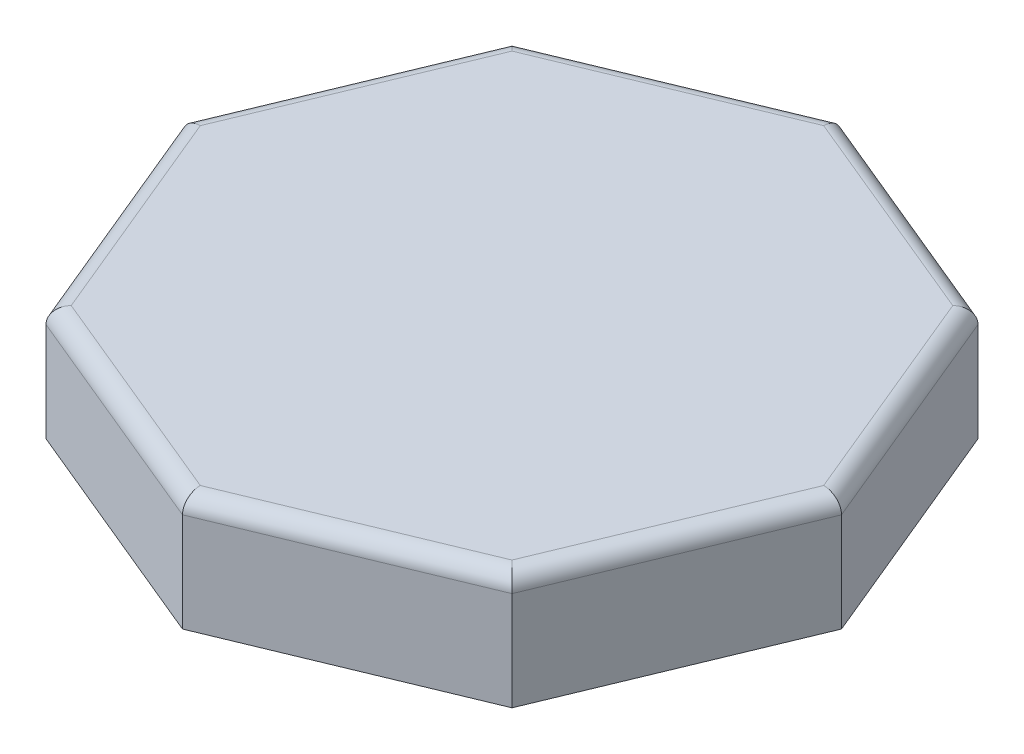
ISO-10303-21;
HEADER;
FILE_DESCRIPTION(('STEP AP214'),'2;1');
FILE_NAME('part.step','',(''),(''),'','','');
FILE_SCHEMA(('AUTOMOTIVE_DESIGN { 1 0 10303 214 1 1 1 1 }'));
ENDSEC;
DATA;
#1=APPLICATION_CONTEXT('core data for automotive mechanical design processes');
#2=APPLICATION_PROTOCOL_DEFINITION('international standard','automotive_design',2000,#1);
#3=PRODUCT_CONTEXT('',#1,'mechanical');
#4=PRODUCT('Part','Part','',(#3));
#5=PRODUCT_RELATED_PRODUCT_CATEGORY('part','',(#4));
#6=PRODUCT_DEFINITION_FORMATION('','',#4);
#7=PRODUCT_DEFINITION_CONTEXT('part definition',#1,'design');
#8=PRODUCT_DEFINITION('design','',#6,#7);
#9=PRODUCT_DEFINITION_SHAPE('','',#8);
#10=(LENGTH_UNIT() NAMED_UNIT(*) SI_UNIT(.MILLI.,.METRE.));
#11=(NAMED_UNIT(*) PLANE_ANGLE_UNIT() SI_UNIT($,.RADIAN.));
#12=(NAMED_UNIT(*) SI_UNIT($,.STERADIAN.) SOLID_ANGLE_UNIT());
#13=UNCERTAINTY_MEASURE_WITH_UNIT(LENGTH_MEASURE(1.E-05),#10,'distance_accuracy_value','');
#14=(GEOMETRIC_REPRESENTATION_CONTEXT(3) GLOBAL_UNCERTAINTY_ASSIGNED_CONTEXT((#13)) GLOBAL_UNIT_ASSIGNED_CONTEXT((#10,
#11,#12)) REPRESENTATION_CONTEXT('',''));
#15=CARTESIAN_POINT('',(0.,0.,0.));
#16=DIRECTION('',(0.,0.,1.));
#17=DIRECTION('',(1.,0.,0.));
#18=AXIS2_PLACEMENT_3D('',#15,#16,#17);
#19=CARTESIAN_POINT('',(0.,70.,199.904133626086));
#20=DIRECTION('',(-0.38268343236509,0.,-0.923879532511286));
#21=DIRECTION('',(-0.923879532511287,0.,0.382683432365091));
#22=AXIS2_PLACEMENT_3D('',#19,#20,#21);
#23=PLANE('',#22);
#24=DIRECTION('',(0.,-1.,0.));
#25=VECTOR('',#24,1.);
#26=CARTESIAN_POINT('',(141.353568474227,70.,141.353568474227));
#27=LINE('',#26,#25);
#28=CARTESIAN_POINT('',(141.353568474227,60.,141.353568474227));
#29=VERTEX_POINT('',#28);
#30=CARTESIAN_POINT('',(141.353568474227,0.,141.353568474227));
#31=VERTEX_POINT('',#30);
#32=EDGE_CURVE('E276',#29,#31,#27,.T.);
#33=ORIENTED_EDGE('',*,*,#32,.F.);
#34=DIRECTION('',(0.923879532511287,0.,-0.382683432365091));
#35=VECTOR('',#34,1.);
#36=CARTESIAN_POINT('',(0.,60.,199.904133626086));
#37=LINE('',#36,#35);
#38=CARTESIAN_POINT('',(0.,60.,199.904133626086));
#39=VERTEX_POINT('',#38);
#40=EDGE_CURVE('E298',#29,#39,#37,.F.);
#41=ORIENTED_EDGE('',*,*,#40,.T.);
#42=DIRECTION('',(0.,-1.,0.));
#43=VECTOR('',#42,1.);
#44=CARTESIAN_POINT('',(0.,70.,199.904133626086));
#45=LINE('',#44,#43);
#46=CARTESIAN_POINT('',(0.,0.,199.904133626086));
#47=VERTEX_POINT('',#46);
#48=EDGE_CURVE('E262',#39,#47,#45,.T.);
#49=ORIENTED_EDGE('',*,*,#48,.T.);
#50=DIRECTION('',(0.923879532511287,0.,-0.38268343236509));
#51=VECTOR('',#50,1.);
#52=CARTESIAN_POINT('',(0.,0.,199.904133626086));
#53=LINE('',#52,#51);
#54=EDGE_CURVE('E238',#47,#31,#53,.T.);
#55=ORIENTED_EDGE('',*,*,#54,.T.);
#56=EDGE_LOOP('',(#33,#41,#49,#55));
#57=FACE_BOUND('',#56,.T.);
#58=ADVANCED_FACE('F32',(#57),#23,.F.);
#59=CARTESIAN_POINT('',(141.353568474227,70.,141.353568474227));
#60=DIRECTION('',(-0.923879532511287,0.,-0.382683432365089));
#61=DIRECTION('',(-0.38268343236509,0.,0.923879532511287));
#62=AXIS2_PLACEMENT_3D('',#59,#60,#61);
#63=PLANE('',#62);
#64=DIRECTION('',(0.,-1.,0.));
#65=VECTOR('',#64,1.);
#66=CARTESIAN_POINT('',(199.904133626086,70.,0.));
#67=LINE('',#66,#65);
#68=CARTESIAN_POINT('',(199.904133626086,60.,0.));
#69=VERTEX_POINT('',#68);
#70=CARTESIAN_POINT('',(199.904133626086,0.,0.));
#71=VERTEX_POINT('',#70);
#72=EDGE_CURVE('E274',#69,#71,#67,.T.);
#73=ORIENTED_EDGE('',*,*,#72,.F.);
#74=DIRECTION('',(0.38268343236509,0.,-0.923879532511287));
#75=VECTOR('',#74,1.);
#76=CARTESIAN_POINT('',(141.353568474227,60.,141.353568474227));
#77=LINE('',#76,#75);
#78=EDGE_CURVE('E295',#69,#29,#77,.F.);
#79=ORIENTED_EDGE('',*,*,#78,.T.);
#80=ORIENTED_EDGE('',*,*,#32,.T.);
#81=DIRECTION('',(0.382683432365089,0.,-0.923879532511287));
#82=VECTOR('',#81,1.);
#83=CARTESIAN_POINT('',(141.353568474227,0.,141.353568474227));
#84=LINE('',#83,#82);
#85=EDGE_CURVE('E241',#31,#71,#84,.T.);
#86=ORIENTED_EDGE('',*,*,#85,.T.);
#87=EDGE_LOOP('',(#73,#79,#80,#86));
#88=FACE_BOUND('',#87,.T.);
#89=ADVANCED_FACE('F450',(#88),#63,.F.);
#90=CARTESIAN_POINT('',(199.904133626086,70.,0.));
#91=DIRECTION('',(-0.923879532511287,0.,0.382683432365089));
#92=DIRECTION('',(0.382683432365089,0.,0.923879532511287));
#93=AXIS2_PLACEMENT_3D('',#90,#91,#92);
#94=PLANE('',#93);
#95=DIRECTION('',(0.,-1.,0.));
#96=VECTOR('',#95,1.);
#97=CARTESIAN_POINT('',(141.353568474227,70.,-141.353568474227));
#98=LINE('',#97,#96);
#99=CARTESIAN_POINT('',(141.353568474227,60.,-141.353568474227));
#100=VERTEX_POINT('',#99);
#101=CARTESIAN_POINT('',(141.353568474227,0.,-141.353568474227));
#102=VERTEX_POINT('',#101);
#103=EDGE_CURVE('E272',#100,#102,#98,.T.);
#104=ORIENTED_EDGE('',*,*,#103,.F.);
#105=DIRECTION('',(-0.382683432365089,0.,-0.923879532511287));
#106=VECTOR('',#105,1.);
#107=CARTESIAN_POINT('',(199.904133626086,60.,0.));
#108=LINE('',#107,#106);
#109=EDGE_CURVE('E310',#100,#69,#108,.F.);
#110=ORIENTED_EDGE('',*,*,#109,.T.);
#111=ORIENTED_EDGE('',*,*,#72,.T.);
#112=DIRECTION('',(-0.382683432365089,0.,-0.923879532511287));
#113=VECTOR('',#112,1.);
#114=CARTESIAN_POINT('',(199.904133626086,0.,0.));
#115=LINE('',#114,#113);
#116=EDGE_CURVE('E244',#71,#102,#115,.T.);
#117=ORIENTED_EDGE('',*,*,#116,.T.);
#118=EDGE_LOOP('',(#104,#110,#111,#117));
#119=FACE_BOUND('',#118,.T.);
#120=ADVANCED_FACE('F456',(#119),#94,.F.);
#121=CARTESIAN_POINT('',(141.353568474227,70.,-141.353568474227));
#122=DIRECTION('',(-0.38268343236509,0.,0.923879532511286));
#123=DIRECTION('',(0.923879532511287,0.,0.382683432365091));
#124=AXIS2_PLACEMENT_3D('',#121,#122,#123);
#125=PLANE('',#124);
#126=DIRECTION('',(0.,-1.,0.));
#127=VECTOR('',#126,1.);
#128=CARTESIAN_POINT('',(0.,70.,-199.904133626086));
#129=LINE('',#128,#127);
#130=CARTESIAN_POINT('',(0.,60.,-199.904133626086));
#131=VERTEX_POINT('',#130);
#132=CARTESIAN_POINT('',(0.,0.,-199.904133626086));
#133=VERTEX_POINT('',#132);
#134=EDGE_CURVE('E270',#131,#133,#129,.T.);
#135=ORIENTED_EDGE('',*,*,#134,.F.);
#136=DIRECTION('',(-0.923879532511287,0.,-0.382683432365091));
#137=VECTOR('',#136,1.);
#138=CARTESIAN_POINT('',(141.353568474227,60.,-141.353568474227));
#139=LINE('',#138,#137);
#140=EDGE_CURVE('E308',#131,#100,#139,.F.);
#141=ORIENTED_EDGE('',*,*,#140,.T.);
#142=ORIENTED_EDGE('',*,*,#103,.T.);
#143=DIRECTION('',(-0.923879532511287,0.,-0.38268343236509));
#144=VECTOR('',#143,1.);
#145=CARTESIAN_POINT('',(141.353568474227,0.,-141.353568474227));
#146=LINE('',#145,#144);
#147=EDGE_CURVE('E247',#102,#133,#146,.T.);
#148=ORIENTED_EDGE('',*,*,#147,.T.);
#149=EDGE_LOOP('',(#135,#141,#142,#148));
#150=FACE_BOUND('',#149,.T.);
#151=ADVANCED_FACE('F510',(#150),#125,.F.);
#152=CARTESIAN_POINT('',(0.,70.,-199.904133626086));
#153=DIRECTION('',(0.38268343236509,0.,0.923879532511287));
#154=DIRECTION('',(0.923879532511287,0.,-0.38268343236509));
#155=AXIS2_PLACEMENT_3D('',#152,#153,#154);
#156=PLANE('',#155);
#157=DIRECTION('',(0.,-1.,0.));
#158=VECTOR('',#157,1.);
#159=CARTESIAN_POINT('',(-141.353568474227,70.,-141.353568474227));
#160=LINE('',#159,#158);
#161=CARTESIAN_POINT('',(-141.353568474227,60.,-141.353568474227));
#162=VERTEX_POINT('',#161);
#163=CARTESIAN_POINT('',(-141.353568474227,0.,-141.353568474227));
#164=VERTEX_POINT('',#163);
#165=EDGE_CURVE('E268',#162,#164,#160,.T.);
#166=ORIENTED_EDGE('',*,*,#165,.F.);
#167=DIRECTION('',(-0.923879532511287,0.,0.38268343236509));
#168=VECTOR('',#167,1.);
#169=CARTESIAN_POINT('',(0.,60.,-199.904133626086));
#170=LINE('',#169,#168);
#171=EDGE_CURVE('E306',#162,#131,#170,.F.);
#172=ORIENTED_EDGE('',*,*,#171,.T.);
#173=ORIENTED_EDGE('',*,*,#134,.T.);
#174=DIRECTION('',(-0.923879532511287,0.,0.38268343236509));
#175=VECTOR('',#174,1.);
#176=CARTESIAN_POINT('',(0.,0.,-199.904133626086));
#177=LINE('',#176,#175);
#178=EDGE_CURVE('E250',#133,#164,#177,.T.);
#179=ORIENTED_EDGE('',*,*,#178,.T.);
#180=EDGE_LOOP('',(#166,#172,#173,#179));
#181=FACE_BOUND('',#180,.T.);
#182=ADVANCED_FACE('F508',(#181),#156,.F.);
#183=CARTESIAN_POINT('',(-141.353568474227,70.,-141.353568474227));
#184=DIRECTION('',(0.923879532511286,0.,0.38268343236509));
#185=DIRECTION('',(0.382683432365091,0.,-0.923879532511287));
#186=AXIS2_PLACEMENT_3D('',#183,#184,#185);
#187=PLANE('',#186);
#188=DIRECTION('',(0.,-1.,0.));
#189=VECTOR('',#188,1.);
#190=CARTESIAN_POINT('',(-199.904133626086,70.,-1.08143630312998E-13));
#191=LINE('',#190,#189);
#192=CARTESIAN_POINT('',(-199.904133626086,60.,-1.08143630312998E-13));
#193=VERTEX_POINT('',#192);
#194=CARTESIAN_POINT('',(-199.904133626086,0.,-1.08143630312998E-13));
#195=VERTEX_POINT('',#194);
#196=EDGE_CURVE('E266',#193,#195,#191,.T.);
#197=ORIENTED_EDGE('',*,*,#196,.F.);
#198=DIRECTION('',(-0.382683432365091,0.,0.923879532511287));
#199=VECTOR('',#198,1.);
#200=CARTESIAN_POINT('',(-141.353568474227,60.,-141.353568474227));
#201=LINE('',#200,#199);
#202=EDGE_CURVE('E304',#193,#162,#201,.F.);
#203=ORIENTED_EDGE('',*,*,#202,.T.);
#204=ORIENTED_EDGE('',*,*,#165,.T.);
#205=DIRECTION('',(-0.38268343236509,0.,0.923879532511286));
#206=VECTOR('',#205,1.);
#207=CARTESIAN_POINT('',(-141.353568474227,0.,-141.353568474227));
#208=LINE('',#207,#206);
#209=EDGE_CURVE('E253',#164,#195,#208,.T.);
#210=ORIENTED_EDGE('',*,*,#209,.T.);
#211=EDGE_LOOP('',(#197,#203,#204,#210));
#212=FACE_BOUND('',#211,.T.);
#213=ADVANCED_FACE('F521',(#212),#187,.F.);
#214=CARTESIAN_POINT('',(-199.904133626086,70.,-1.08143630312998E-13));
#215=DIRECTION('',(0.923879532511287,0.,-0.38268343236509));
#216=DIRECTION('',(-0.38268343236509,0.,-0.923879532511287));
#217=AXIS2_PLACEMENT_3D('',#214,#215,#216);
#218=PLANE('',#217);
#219=DIRECTION('',(0.,-1.,0.));
#220=VECTOR('',#219,1.);
#221=CARTESIAN_POINT('',(-141.353568474227,70.,141.353568474227));
#222=LINE('',#221,#220);
#223=CARTESIAN_POINT('',(-141.353568474227,60.,141.353568474227));
#224=VERTEX_POINT('',#223);
#225=CARTESIAN_POINT('',(-141.353568474227,0.,141.353568474227));
#226=VERTEX_POINT('',#225);
#227=EDGE_CURVE('E264',#224,#226,#222,.T.);
#228=ORIENTED_EDGE('',*,*,#227,.F.);
#229=DIRECTION('',(0.38268343236509,0.,0.923879532511287));
#230=VECTOR('',#229,1.);
#231=CARTESIAN_POINT('',(-199.904133626086,60.,-1.29109219494897E-13));
#232=LINE('',#231,#230);
#233=EDGE_CURVE('E302',#224,#193,#232,.F.);
#234=ORIENTED_EDGE('',*,*,#233,.T.);
#235=ORIENTED_EDGE('',*,*,#196,.T.);
#236=DIRECTION('',(0.38268343236509,0.,0.923879532511287));
#237=VECTOR('',#236,1.);
#238=CARTESIAN_POINT('',(-199.904133626086,0.,-1.08143630312998E-13));
#239=LINE('',#238,#237);
#240=EDGE_CURVE('E256',#195,#226,#239,.T.);
#241=ORIENTED_EDGE('',*,*,#240,.T.);
#242=EDGE_LOOP('',(#228,#234,#235,#241));
#243=FACE_BOUND('',#242,.T.);
#244=ADVANCED_FACE('F524',(#243),#218,.F.);
#245=CARTESIAN_POINT('',(-141.353568474227,70.,141.353568474227));
#246=DIRECTION('',(0.38268343236509,0.,-0.923879532511287));
#247=DIRECTION('',(-0.923879532511287,0.,-0.38268343236509));
#248=AXIS2_PLACEMENT_3D('',#245,#246,#247);
#249=PLANE('',#248);
#250=ORIENTED_EDGE('',*,*,#48,.F.);
#251=DIRECTION('',(0.923879532511287,0.,0.38268343236509));
#252=VECTOR('',#251,1.);
#253=CARTESIAN_POINT('',(-141.353568474227,60.,141.353568474227));
#254=LINE('',#253,#252);
#255=EDGE_CURVE('E300',#39,#224,#254,.F.);
#256=ORIENTED_EDGE('',*,*,#255,.T.);
#257=ORIENTED_EDGE('',*,*,#227,.T.);
#258=DIRECTION('',(0.923879532511287,0.,0.38268343236509));
#259=VECTOR('',#258,1.);
#260=CARTESIAN_POINT('',(-141.353568474227,0.,141.353568474227));
#261=LINE('',#260,#259);
#262=EDGE_CURVE('E259',#226,#47,#261,.T.);
#263=ORIENTED_EDGE('',*,*,#262,.T.);
#264=EDGE_LOOP('',(#250,#256,#257,#263));
#265=FACE_BOUND('',#264,.T.);
#266=ADVANCED_FACE('F548',(#265),#249,.F.);
#267=CARTESIAN_POINT('',(0.,70.,0.));
#268=DIRECTION('',(0.,1.,0.));
#269=DIRECTION('',(0.,0.,1.));
#270=AXIS2_PLACEMENT_3D('',#267,#268,#269);
#271=PLANE('',#270);
#272=DIRECTION('',(0.923879532511287,0.,-0.382683432365091));
#273=VECTOR('',#272,1.);
#274=CARTESIAN_POINT('',(137.526734150576,70.,132.114773149114));
#275=LINE('',#274,#273);
#276=CARTESIAN_POINT('',(0.,70.,189.080211623162));
#277=VERTEX_POINT('',#276);
#278=CARTESIAN_POINT('',(133.699899826925,70.,133.699899826925));
#279=VERTEX_POINT('',#278);
#280=EDGE_CURVE('E290',#277,#279,#275,.T.);
#281=ORIENTED_EDGE('',*,*,#280,.T.);
#282=DIRECTION('',(0.38268343236509,0.,-0.923879532511287));
#283=VECTOR('',#282,1.);
#284=CARTESIAN_POINT('',(190.665338300973,70.,-3.82683432365089));
#285=LINE('',#284,#283);
#286=CARTESIAN_POINT('',(189.080211623162,70.,0.));
#287=VERTEX_POINT('',#286);
#288=EDGE_CURVE('E292',#279,#287,#285,.T.);
#289=ORIENTED_EDGE('',*,*,#288,.T.);
#290=DIRECTION('',(-0.382683432365089,0.,-0.923879532511287));
#291=VECTOR('',#290,1.);
#292=CARTESIAN_POINT('',(132.114773149114,70.,-137.526734150576));
#293=LINE('',#292,#291);
#294=CARTESIAN_POINT('',(133.699899826925,70.,-133.699899826925));
#295=VERTEX_POINT('',#294);
#296=EDGE_CURVE('E278',#287,#295,#293,.T.);
#297=ORIENTED_EDGE('',*,*,#296,.T.);
#298=DIRECTION('',(-0.923879532511287,0.,-0.382683432365091));
#299=VECTOR('',#298,1.);
#300=CARTESIAN_POINT('',(-3.82683432365093,70.,-190.665338300973));
#301=LINE('',#300,#299);
#302=CARTESIAN_POINT('',(0.,70.,-189.080211623162));
#303=VERTEX_POINT('',#302);
#304=EDGE_CURVE('E280',#295,#303,#301,.T.);
#305=ORIENTED_EDGE('',*,*,#304,.T.);
#306=DIRECTION('',(-0.923879532511287,0.,0.38268343236509));
#307=VECTOR('',#306,1.);
#308=CARTESIAN_POINT('',(-137.526734150576,70.,-132.114773149114));
#309=LINE('',#308,#307);
#310=CARTESIAN_POINT('',(-133.699899826925,70.,-133.699899826925));
#311=VERTEX_POINT('',#310);
#312=EDGE_CURVE('E282',#303,#311,#309,.T.);
#313=ORIENTED_EDGE('',*,*,#312,.T.);
#314=DIRECTION('',(-0.382683432365091,0.,0.923879532511287));
#315=VECTOR('',#314,1.);
#316=CARTESIAN_POINT('',(-190.665338300973,70.,3.82683432365082));
#317=LINE('',#316,#315);
#318=CARTESIAN_POINT('',(-189.080211623162,70.,-1.07514752832717E-13));
#319=VERTEX_POINT('',#318);
#320=EDGE_CURVE('E284',#311,#319,#317,.T.);
#321=ORIENTED_EDGE('',*,*,#320,.T.);
#322=DIRECTION('',(0.38268343236509,0.,0.923879532511287));
#323=VECTOR('',#322,1.);
#324=CARTESIAN_POINT('',(-132.114773149114,70.,137.526734150576));
#325=LINE('',#324,#323);
#326=CARTESIAN_POINT('',(-133.699899826925,70.,133.699899826925));
#327=VERTEX_POINT('',#326);
#328=EDGE_CURVE('E286',#319,#327,#325,.T.);
#329=ORIENTED_EDGE('',*,*,#328,.T.);
#330=DIRECTION('',(0.923879532511287,0.,0.38268343236509));
#331=VECTOR('',#330,1.);
#332=CARTESIAN_POINT('',(3.82683432365094,70.,190.665338300973));
#333=LINE('',#332,#331);
#334=EDGE_CURVE('E288',#327,#277,#333,.T.);
#335=ORIENTED_EDGE('',*,*,#334,.T.);
#336=EDGE_LOOP('',(#281,#289,#297,#305,#313,#321,#329,#335));
#337=FACE_BOUND('',#336,.T.);
#338=ADVANCED_FACE('F533',(#337),#271,.T.);
#339=CARTESIAN_POINT('',(0.,0.,0.));
#340=DIRECTION('',(0.,1.,0.));
#341=DIRECTION('',(0.,0.,1.));
#342=AXIS2_PLACEMENT_3D('',#339,#340,#341);
#343=PLANE('',#342);
#344=DIRECTION('',(0.923879532511287,0.,0.38268343236509));
#345=VECTOR('',#344,1.);
#346=CARTESIAN_POINT('',(-140.205518177132,0.,138.581929876693));
#347=LINE('',#346,#345);
#348=CARTESIAN_POINT('',(-139.057467880036,0.,139.057467880036));
#349=VERTEX_POINT('',#348);
#350=CARTESIAN_POINT('',(0.,0.,196.656957025208));
#351=VERTEX_POINT('',#350);
#352=EDGE_CURVE('E198',#349,#351,#347,.T.);
#353=ORIENTED_EDGE('',*,*,#352,.T.);
#354=DIRECTION('',(0.923879532511287,0.,-0.382683432365091));
#355=VECTOR('',#354,1.);
#356=CARTESIAN_POINT('',(-1.14805029709527,0.,197.132495028552));
#357=LINE('',#356,#355);
#358=CARTESIAN_POINT('',(139.057467880037,0.,139.057467880036));
#359=VERTEX_POINT('',#358);
#360=EDGE_CURVE('E207',#351,#359,#357,.T.);
#361=ORIENTED_EDGE('',*,*,#360,.T.);
#362=DIRECTION('',(0.38268343236509,0.,-0.923879532511287));
#363=VECTOR('',#362,1.);
#364=CARTESIAN_POINT('',(138.581929876693,0.,140.205518177131));
#365=LINE('',#364,#363);
#366=CARTESIAN_POINT('',(196.656957025208,0.,0.));
#367=VERTEX_POINT('',#366);
#368=EDGE_CURVE('E214',#359,#367,#365,.T.);
#369=ORIENTED_EDGE('',*,*,#368,.T.);
#370=DIRECTION('',(-0.382683432365089,0.,-0.923879532511287));
#371=VECTOR('',#370,1.);
#372=CARTESIAN_POINT('',(197.132495028552,0.,1.1480502970953));
#373=LINE('',#372,#371);
#374=CARTESIAN_POINT('',(139.057467880037,0.,-139.057467880036));
#375=VERTEX_POINT('',#374);
#376=EDGE_CURVE('E234',#367,#375,#373,.T.);
#377=ORIENTED_EDGE('',*,*,#376,.T.);
#378=DIRECTION('',(-0.923879532511287,0.,-0.382683432365091));
#379=VECTOR('',#378,1.);
#380=CARTESIAN_POINT('',(140.205518177132,0.,-138.581929876693));
#381=LINE('',#380,#379);
#382=CARTESIAN_POINT('',(0.,0.,-196.656957025208));
#383=VERTEX_POINT('',#382);
#384=EDGE_CURVE('E231',#375,#383,#381,.T.);
#385=ORIENTED_EDGE('',*,*,#384,.T.);
#386=DIRECTION('',(-0.923879532511287,0.,0.38268343236509));
#387=VECTOR('',#386,1.);
#388=CARTESIAN_POINT('',(1.14805029709527,0.,-197.132495028552));
#389=LINE('',#388,#387);
#390=CARTESIAN_POINT('',(-139.057467880036,0.,-139.057467880036));
#391=VERTEX_POINT('',#390);
#392=EDGE_CURVE('E228',#383,#391,#389,.T.);
#393=ORIENTED_EDGE('',*,*,#392,.T.);
#394=DIRECTION('',(-0.382683432365091,0.,0.923879532511287));
#395=VECTOR('',#394,1.);
#396=CARTESIAN_POINT('',(-138.581929876693,0.,-140.205518177132));
#397=LINE('',#396,#395);
#398=CARTESIAN_POINT('',(-196.656957025209,0.,-1.05453731169973E-13));
#399=VERTEX_POINT('',#398);
#400=EDGE_CURVE('E223',#391,#399,#397,.T.);
#401=ORIENTED_EDGE('',*,*,#400,.T.);
#402=DIRECTION('',(0.38268343236509,0.,0.923879532511287));
#403=VECTOR('',#402,1.);
#404=CARTESIAN_POINT('',(-197.132495028552,0.,-1.14805029709538));
#405=LINE('',#404,#403);
#406=EDGE_CURVE('E221',#399,#349,#405,.T.);
#407=ORIENTED_EDGE('',*,*,#406,.T.);
#408=EDGE_LOOP('',(#353,#361,#369,#377,#385,#393,#401,#407));
#409=FACE_BOUND('',#408,.T.);
#410=ORIENTED_EDGE('',*,*,#54,.F.);
#411=ORIENTED_EDGE('',*,*,#262,.F.);
#412=ORIENTED_EDGE('',*,*,#240,.F.);
#413=ORIENTED_EDGE('',*,*,#209,.F.);
#414=ORIENTED_EDGE('',*,*,#178,.F.);
#415=ORIENTED_EDGE('',*,*,#147,.F.);
#416=ORIENTED_EDGE('',*,*,#116,.F.);
#417=ORIENTED_EDGE('',*,*,#85,.F.);
#418=EDGE_LOOP('',(#410,#411,#412,#413,#414,#415,#416,#417));
#419=FACE_BOUND('',#418,.T.);
#420=ADVANCED_FACE('F217',(#409,#419),#343,.F.);
#421=CARTESIAN_POINT('',(-1.14805029709527,70.,197.132495028552));
#422=DIRECTION('',(-0.38268343236509,0.,-0.923879532511286));
#423=DIRECTION('',(-0.923879532511287,0.,0.382683432365091));
#424=AXIS2_PLACEMENT_3D('',#421,#422,#423);
#425=PLANE('',#424);
#426=DIRECTION('',(0.,-1.,0.));
#427=VECTOR('',#426,1.);
#428=CARTESIAN_POINT('',(0.,70.,196.656957025208));
#429=LINE('',#428,#427);
#430=CARTESIAN_POINT('',(0.,64.,196.656957025208));
#431=VERTEX_POINT('',#430);
#432=EDGE_CURVE('E193',#431,#351,#429,.T.);
#433=ORIENTED_EDGE('',*,*,#432,.F.);
#434=DIRECTION('',(0.923879532511287,0.,-0.382683432365091));
#435=VECTOR('',#434,1.);
#436=CARTESIAN_POINT('',(-1.14805029709527,64.,197.132495028552));
#437=LINE('',#436,#435);
#438=CARTESIAN_POINT('',(139.057467880037,64.,139.057467880036));
#439=VERTEX_POINT('',#438);
#440=EDGE_CURVE('E355',#431,#439,#437,.T.);
#441=ORIENTED_EDGE('',*,*,#440,.T.);
#442=DIRECTION('',(0.,-1.,0.));
#443=VECTOR('',#442,1.);
#444=CARTESIAN_POINT('',(139.057467880037,70.,139.057467880036));
#445=LINE('',#444,#443);
#446=EDGE_CURVE('E210',#439,#359,#445,.T.);
#447=ORIENTED_EDGE('',*,*,#446,.T.);
#448=ORIENTED_EDGE('',*,*,#360,.F.);
#449=EDGE_LOOP('',(#433,#441,#447,#448));
#450=FACE_BOUND('',#449,.T.);
#451=ADVANCED_FACE('F208',(#450),#425,.T.);
#452=CARTESIAN_POINT('',(138.581929876693,70.,140.205518177131));
#453=DIRECTION('',(-0.923879532511287,0.,-0.382683432365089));
#454=DIRECTION('',(-0.38268343236509,0.,0.923879532511287));
#455=AXIS2_PLACEMENT_3D('',#452,#453,#454);
#456=PLANE('',#455);
#457=ORIENTED_EDGE('',*,*,#446,.F.);
#458=DIRECTION('',(0.38268343236509,0.,-0.923879532511287));
#459=VECTOR('',#458,1.);
#460=CARTESIAN_POINT('',(138.581929876693,64.,140.205518177131));
#461=LINE('',#460,#459);
#462=CARTESIAN_POINT('',(196.656957025208,64.,0.));
#463=VERTEX_POINT('',#462);
#464=EDGE_CURVE('E353',#439,#463,#461,.T.);
#465=ORIENTED_EDGE('',*,*,#464,.T.);
#466=DIRECTION('',(0.,-1.,0.));
#467=VECTOR('',#466,1.);
#468=CARTESIAN_POINT('',(196.656957025208,70.,0.));
#469=LINE('',#468,#467);
#470=EDGE_CURVE('E409',#463,#367,#469,.T.);
#471=ORIENTED_EDGE('',*,*,#470,.T.);
#472=ORIENTED_EDGE('',*,*,#368,.F.);
#473=EDGE_LOOP('',(#457,#465,#471,#472));
#474=FACE_BOUND('',#473,.T.);
#475=ADVANCED_FACE('F408',(#474),#456,.T.);
#476=CARTESIAN_POINT('',(197.132495028552,70.,1.1480502970953));
#477=DIRECTION('',(-0.923879532511287,0.,0.382683432365089));
#478=DIRECTION('',(0.382683432365089,0.,0.923879532511287));
#479=AXIS2_PLACEMENT_3D('',#476,#477,#478);
#480=PLANE('',#479);
#481=ORIENTED_EDGE('',*,*,#470,.F.);
#482=DIRECTION('',(-0.382683432365089,0.,-0.923879532511287));
#483=VECTOR('',#482,1.);
#484=CARTESIAN_POINT('',(197.132495028552,64.,1.1480502970953));
#485=LINE('',#484,#483);
#486=CARTESIAN_POINT('',(139.057467880037,64.,-139.057467880036));
#487=VERTEX_POINT('',#486);
#488=EDGE_CURVE('E312',#463,#487,#485,.T.);
#489=ORIENTED_EDGE('',*,*,#488,.T.);
#490=DIRECTION('',(0.,-1.,0.));
#491=VECTOR('',#490,1.);
#492=CARTESIAN_POINT('',(139.057467880037,70.,-139.057467880036));
#493=LINE('',#492,#491);
#494=EDGE_CURVE('E413',#487,#375,#493,.T.);
#495=ORIENTED_EDGE('',*,*,#494,.T.);
#496=ORIENTED_EDGE('',*,*,#376,.F.);
#497=EDGE_LOOP('',(#481,#489,#495,#496));
#498=FACE_BOUND('',#497,.T.);
#499=ADVANCED_FACE('F412',(#498),#480,.T.);
#500=CARTESIAN_POINT('',(140.205518177132,70.,-138.581929876693));
#501=DIRECTION('',(-0.38268343236509,0.,0.923879532511286));
#502=DIRECTION('',(0.923879532511287,0.,0.382683432365091));
#503=AXIS2_PLACEMENT_3D('',#500,#501,#502);
#504=PLANE('',#503);
#505=ORIENTED_EDGE('',*,*,#494,.F.);
#506=DIRECTION('',(-0.923879532511287,0.,-0.382683432365091));
#507=VECTOR('',#506,1.);
#508=CARTESIAN_POINT('',(140.205518177132,64.,-138.581929876693));
#509=LINE('',#508,#507);
#510=CARTESIAN_POINT('',(0.,64.,-196.656957025208));
#511=VERTEX_POINT('',#510);
#512=EDGE_CURVE('E11',#487,#511,#509,.T.);
#513=ORIENTED_EDGE('',*,*,#512,.T.);
#514=DIRECTION('',(0.,-1.,0.));
#515=VECTOR('',#514,1.);
#516=CARTESIAN_POINT('',(0.,70.,-196.656957025208));
#517=LINE('',#516,#515);
#518=EDGE_CURVE('E416',#511,#383,#517,.T.);
#519=ORIENTED_EDGE('',*,*,#518,.T.);
#520=ORIENTED_EDGE('',*,*,#384,.F.);
#521=EDGE_LOOP('',(#505,#513,#519,#520));
#522=FACE_BOUND('',#521,.T.);
#523=ADVANCED_FACE('F671',(#522),#504,.T.);
#524=CARTESIAN_POINT('',(1.14805029709527,70.,-197.132495028552));
#525=DIRECTION('',(0.38268343236509,0.,0.923879532511287));
#526=DIRECTION('',(0.923879532511287,0.,-0.38268343236509));
#527=AXIS2_PLACEMENT_3D('',#524,#525,#526);
#528=PLANE('',#527);
#529=ORIENTED_EDGE('',*,*,#518,.F.);
#530=DIRECTION('',(-0.923879532511287,0.,0.38268343236509));
#531=VECTOR('',#530,1.);
#532=CARTESIAN_POINT('',(1.14805029709527,64.,-197.132495028552));
#533=LINE('',#532,#531);
#534=CARTESIAN_POINT('',(-139.057467880036,64.,-139.057467880036));
#535=VERTEX_POINT('',#534);
#536=EDGE_CURVE('E41',#511,#535,#533,.T.);
#537=ORIENTED_EDGE('',*,*,#536,.T.);
#538=DIRECTION('',(0.,-1.,0.));
#539=VECTOR('',#538,1.);
#540=CARTESIAN_POINT('',(-139.057467880036,70.,-139.057467880036));
#541=LINE('',#540,#539);
#542=EDGE_CURVE('E420',#535,#391,#541,.T.);
#543=ORIENTED_EDGE('',*,*,#542,.T.);
#544=ORIENTED_EDGE('',*,*,#392,.F.);
#545=EDGE_LOOP('',(#529,#537,#543,#544));
#546=FACE_BOUND('',#545,.T.);
#547=ADVANCED_FACE('F680',(#546),#528,.T.);
#548=CARTESIAN_POINT('',(-138.581929876693,70.,-140.205518177132));
#549=DIRECTION('',(0.923879532511286,0.,0.38268343236509));
#550=DIRECTION('',(0.382683432365091,0.,-0.923879532511287));
#551=AXIS2_PLACEMENT_3D('',#548,#549,#550);
#552=PLANE('',#551);
#553=ORIENTED_EDGE('',*,*,#542,.F.);
#554=DIRECTION('',(-0.382683432365091,0.,0.923879532511287));
#555=VECTOR('',#554,1.);
#556=CARTESIAN_POINT('',(-138.581929876693,64.,-140.205518177132));
#557=LINE('',#556,#555);
#558=CARTESIAN_POINT('',(-196.656957025209,64.,0.));
#559=VERTEX_POINT('',#558);
#560=EDGE_CURVE('E360',#535,#559,#557,.T.);
#561=ORIENTED_EDGE('',*,*,#560,.T.);
#562=DIRECTION('',(0.,-1.,0.));
#563=VECTOR('',#562,1.);
#564=CARTESIAN_POINT('',(-196.656957025209,70.,0.));
#565=LINE('',#564,#563);
#566=EDGE_CURVE('E422',#559,#399,#565,.T.);
#567=ORIENTED_EDGE('',*,*,#566,.T.);
#568=ORIENTED_EDGE('',*,*,#400,.F.);
#569=EDGE_LOOP('',(#553,#561,#567,#568));
#570=FACE_BOUND('',#569,.T.);
#571=ADVANCED_FACE('F428',(#570),#552,.T.);
#572=CARTESIAN_POINT('',(-197.132495028552,70.,-1.14805029709538));
#573=DIRECTION('',(0.923879532511287,0.,-0.38268343236509));
#574=DIRECTION('',(-0.38268343236509,0.,-0.923879532511287));
#575=AXIS2_PLACEMENT_3D('',#572,#573,#574);
#576=PLANE('',#575);
#577=ORIENTED_EDGE('',*,*,#566,.F.);
#578=DIRECTION('',(0.38268343236509,0.,0.923879532511287));
#579=VECTOR('',#578,1.);
#580=CARTESIAN_POINT('',(-197.132495028552,64.,-1.14805029709538));
#581=LINE('',#580,#579);
#582=CARTESIAN_POINT('',(-139.057467880036,64.,139.057467880036));
#583=VERTEX_POINT('',#582);
#584=EDGE_CURVE('E358',#559,#583,#581,.T.);
#585=ORIENTED_EDGE('',*,*,#584,.T.);
#586=DIRECTION('',(0.,-1.,0.));
#587=VECTOR('',#586,1.);
#588=CARTESIAN_POINT('',(-139.057467880036,70.,139.057467880036));
#589=LINE('',#588,#587);
#590=EDGE_CURVE('E204',#583,#349,#589,.T.);
#591=ORIENTED_EDGE('',*,*,#590,.T.);
#592=ORIENTED_EDGE('',*,*,#406,.F.);
#593=EDGE_LOOP('',(#577,#585,#591,#592));
#594=FACE_BOUND('',#593,.T.);
#595=ADVANCED_FACE('F425',(#594),#576,.T.);
#596=CARTESIAN_POINT('',(-140.205518177132,70.,138.581929876693));
#597=DIRECTION('',(0.38268343236509,0.,-0.923879532511287));
#598=DIRECTION('',(-0.923879532511287,0.,-0.38268343236509));
#599=AXIS2_PLACEMENT_3D('',#596,#597,#598);
#600=PLANE('',#599);
#601=ORIENTED_EDGE('',*,*,#590,.F.);
#602=DIRECTION('',(0.923879532511287,0.,0.38268343236509));
#603=VECTOR('',#602,1.);
#604=CARTESIAN_POINT('',(-140.205518177132,64.,138.581929876693));
#605=LINE('',#604,#603);
#606=EDGE_CURVE('E201',#583,#431,#605,.T.);
#607=ORIENTED_EDGE('',*,*,#606,.T.);
#608=ORIENTED_EDGE('',*,*,#432,.T.);
#609=ORIENTED_EDGE('',*,*,#352,.F.);
#610=EDGE_LOOP('',(#601,#607,#608,#609));
#611=FACE_BOUND('',#610,.T.);
#612=ADVANCED_FACE('F196',(#611),#600,.T.);
#613=CARTESIAN_POINT('',(0.,67.,0.));
#614=DIRECTION('',(0.,1.,0.));
#615=DIRECTION('',(0.,0.,1.));
#616=AXIS2_PLACEMENT_3D('',#613,#614,#615);
#617=PLANE('',#616);
#618=DIRECTION('',(-0.923879532511287,0.,-0.382683432365091));
#619=VECTOR('',#618,1.);
#620=CARTESIAN_POINT('',(68.380683642923,67.,-165.085573855089));
#621=LINE('',#620,#619);
#622=CARTESIAN_POINT('',(0.,67.,-193.409780424331));
#623=VERTEX_POINT('',#622);
#624=CARTESIAN_POINT('',(136.761367285846,67.,-136.761367285846));
#625=VERTEX_POINT('',#624);
#626=EDGE_CURVE('E336',#623,#625,#621,.F.);
#627=ORIENTED_EDGE('',*,*,#626,.T.);
#628=DIRECTION('',(-0.382683432365089,0.,-0.923879532511287));
#629=VECTOR('',#628,1.);
#630=CARTESIAN_POINT('',(165.085573855089,67.,-68.3806836429228));
#631=LINE('',#630,#629);
#632=CARTESIAN_POINT('',(193.409780424331,67.,0.));
#633=VERTEX_POINT('',#632);
#634=EDGE_CURVE('E350',#625,#633,#631,.F.);
#635=ORIENTED_EDGE('',*,*,#634,.T.);
#636=DIRECTION('',(0.38268343236509,0.,-0.923879532511287));
#637=VECTOR('',#636,1.);
#638=CARTESIAN_POINT('',(165.085573855089,67.,68.3806836429229));
#639=LINE('',#638,#637);
#640=CARTESIAN_POINT('',(136.761367285846,67.,136.761367285846));
#641=VERTEX_POINT('',#640);
#642=EDGE_CURVE('E348',#633,#641,#639,.F.);
#643=ORIENTED_EDGE('',*,*,#642,.T.);
#644=DIRECTION('',(0.923879532511287,0.,-0.382683432365091));
#645=VECTOR('',#644,1.);
#646=CARTESIAN_POINT('',(68.380683642923,67.,165.085573855089));
#647=LINE('',#646,#645);
#648=CARTESIAN_POINT('',(0.,67.,193.409780424331));
#649=VERTEX_POINT('',#648);
#650=EDGE_CURVE('E346',#641,#649,#647,.F.);
#651=ORIENTED_EDGE('',*,*,#650,.T.);
#652=DIRECTION('',(0.923879532511287,0.,0.38268343236509));
#653=VECTOR('',#652,1.);
#654=CARTESIAN_POINT('',(-68.380683642923,67.,165.085573855089));
#655=LINE('',#654,#653);
#656=CARTESIAN_POINT('',(-136.761367285846,67.,136.761367285846));
#657=VERTEX_POINT('',#656);
#658=EDGE_CURVE('E344',#649,#657,#655,.F.);
#659=ORIENTED_EDGE('',*,*,#658,.T.);
#660=DIRECTION('',(0.38268343236509,0.,0.923879532511287));
#661=VECTOR('',#660,1.);
#662=CARTESIAN_POINT('',(-165.085573855089,67.,68.3806836429229));
#663=LINE('',#662,#661);
#664=CARTESIAN_POINT('',(-193.409780424331,67.,-1.03169021456944E-13));
#665=VERTEX_POINT('',#664);
#666=EDGE_CURVE('E342',#657,#665,#663,.F.);
#667=ORIENTED_EDGE('',*,*,#666,.T.);
#668=DIRECTION('',(-0.382683432365091,0.,0.923879532511287));
#669=VECTOR('',#668,1.);
#670=CARTESIAN_POINT('',(-165.085573855089,67.,-68.3806836429231));
#671=LINE('',#670,#669);
#672=CARTESIAN_POINT('',(-136.761367285846,67.,-136.761367285846));
#673=VERTEX_POINT('',#672);
#674=EDGE_CURVE('E340',#665,#673,#671,.F.);
#675=ORIENTED_EDGE('',*,*,#674,.T.);
#676=DIRECTION('',(-0.923879532511287,0.,0.38268343236509));
#677=VECTOR('',#676,1.);
#678=CARTESIAN_POINT('',(-68.380683642923,67.,-165.085573855089));
#679=LINE('',#678,#677);
#680=EDGE_CURVE('E338',#673,#623,#679,.F.);
#681=ORIENTED_EDGE('',*,*,#680,.T.);
#682=EDGE_LOOP('',(#627,#635,#643,#651,#659,#667,#675,#681));
#683=FACE_BOUND('',#682,.T.);
#684=ADVANCED_FACE('F393',(#683),#617,.F.);
#685=CARTESIAN_POINT('',(-161.390055725043,60.,-66.8499499134627));
#686=DIRECTION('',(0.382683432365091,0.,-0.923879532511287));
#687=DIRECTION('',(-0.923879532511287,0.,-0.382683432365091));
#688=AXIS2_PLACEMENT_3D('',#685,#686,#687);
#689=CYLINDRICAL_SURFACE('',#688,10.);
#690=CARTESIAN_POINT('',(-133.699899826925,60.,-133.699899826925));
#691=DIRECTION('',(0.707106781186548,0.,-0.707106781186548));
#692=DIRECTION('',(0.707106781186547,0.,0.707106781186548));
#693=AXIS2_PLACEMENT_3D('',#690,#691,#692);
#694=ELLIPSE('',#693,10.8239220029239,10.);
#695=EDGE_CURVE('E329',#162,#311,#694,.T.);
#696=ORIENTED_EDGE('',*,*,#695,.F.);
#697=ORIENTED_EDGE('',*,*,#202,.F.);
#698=CARTESIAN_POINT('',(-189.080211623162,60.,-1.80411241501588E-13));
#699=DIRECTION('',(0.,0.,-1.));
#700=DIRECTION('',(1.,0.,0.));
#701=AXIS2_PLACEMENT_3D('',#698,#699,#700);
#702=ELLIPSE('',#701,10.8239220029239,10.);
#703=EDGE_CURVE('E215',#319,#193,#702,.F.);
#704=ORIENTED_EDGE('',*,*,#703,.F.);
#705=ORIENTED_EDGE('',*,*,#320,.F.);
#706=EDGE_LOOP('',(#696,#697,#704,#705));
#707=FACE_BOUND('',#706,.T.);
#708=ADVANCED_FACE('F489',(#707),#689,.T.);
#709=CARTESIAN_POINT('',(-161.390055725043,60.,66.8499499134626));
#710=DIRECTION('',(-0.38268343236509,0.,-0.923879532511287));
#711=DIRECTION('',(-0.923879532511287,0.,0.38268343236509));
#712=AXIS2_PLACEMENT_3D('',#709,#710,#711);
#713=CYLINDRICAL_SURFACE('',#712,10.);
#714=ORIENTED_EDGE('',*,*,#703,.T.);
#715=ORIENTED_EDGE('',*,*,#233,.F.);
#716=CARTESIAN_POINT('',(-133.699899826925,60.,133.699899826925));
#717=DIRECTION('',(-0.707106781186547,0.,-0.707106781186548));
#718=DIRECTION('',(0.707106781186548,0.,-0.707106781186547));
#719=AXIS2_PLACEMENT_3D('',#716,#717,#718);
#720=ELLIPSE('',#719,10.8239220029239,10.);
#721=EDGE_CURVE('E326',#327,#224,#720,.F.);
#722=ORIENTED_EDGE('',*,*,#721,.F.);
#723=ORIENTED_EDGE('',*,*,#328,.F.);
#724=EDGE_LOOP('',(#714,#715,#722,#723));
#725=FACE_BOUND('',#724,.T.);
#726=ADVANCED_FACE('F485',(#725),#713,.T.);
#727=CARTESIAN_POINT('',(-66.8499499134626,60.,-161.390055725043));
#728=DIRECTION('',(0.923879532511287,0.,-0.38268343236509));
#729=DIRECTION('',(-0.38268343236509,0.,-0.923879532511287));
#730=AXIS2_PLACEMENT_3D('',#727,#728,#729);
#731=CYLINDRICAL_SURFACE('',#730,10.);
#732=ORIENTED_EDGE('',*,*,#695,.T.);
#733=ORIENTED_EDGE('',*,*,#312,.F.);
#734=CARTESIAN_POINT('',(0.,60.,-189.080211623162));
#735=DIRECTION('',(1.,0.,0.));
#736=DIRECTION('',(0.,0.,1.));
#737=AXIS2_PLACEMENT_3D('',#734,#735,#736);
#738=ELLIPSE('',#737,10.8239220029239,10.);
#739=EDGE_CURVE('E323',#131,#303,#738,.T.);
#740=ORIENTED_EDGE('',*,*,#739,.F.);
#741=ORIENTED_EDGE('',*,*,#171,.F.);
#742=EDGE_LOOP('',(#732,#733,#740,#741));
#743=FACE_BOUND('',#742,.T.);
#744=ADVANCED_FACE('F481',(#743),#731,.T.);
#745=CARTESIAN_POINT('',(-66.8499499134626,60.,161.390055725043));
#746=DIRECTION('',(-0.923879532511287,0.,-0.38268343236509));
#747=DIRECTION('',(-0.38268343236509,0.,0.923879532511287));
#748=AXIS2_PLACEMENT_3D('',#745,#746,#747);
#749=CYLINDRICAL_SURFACE('',#748,10.);
#750=ORIENTED_EDGE('',*,*,#721,.T.);
#751=ORIENTED_EDGE('',*,*,#255,.F.);
#752=CARTESIAN_POINT('',(0.,60.,189.080211623162));
#753=DIRECTION('',(-1.,0.,0.));
#754=DIRECTION('',(0.,0.,-1.));
#755=AXIS2_PLACEMENT_3D('',#752,#753,#754);
#756=ELLIPSE('',#755,10.8239220029239,10.);
#757=EDGE_CURVE('E320',#277,#39,#756,.F.);
#758=ORIENTED_EDGE('',*,*,#757,.F.);
#759=ORIENTED_EDGE('',*,*,#334,.F.);
#760=EDGE_LOOP('',(#750,#751,#758,#759));
#761=FACE_BOUND('',#760,.T.);
#762=ADVANCED_FACE('F477',(#761),#749,.T.);
#763=CARTESIAN_POINT('',(66.8499499134627,60.,-161.390055725043));
#764=DIRECTION('',(0.923879532511287,0.,0.382683432365091));
#765=DIRECTION('',(0.382683432365091,0.,-0.923879532511287));
#766=AXIS2_PLACEMENT_3D('',#763,#764,#765);
#767=CYLINDRICAL_SURFACE('',#766,10.);
#768=ORIENTED_EDGE('',*,*,#739,.T.);
#769=ORIENTED_EDGE('',*,*,#304,.F.);
#770=CARTESIAN_POINT('',(133.699899826925,60.,-133.699899826925));
#771=DIRECTION('',(0.707106781186547,0.,0.707106781186548));
#772=DIRECTION('',(-0.707106781186548,0.,0.707106781186547));
#773=AXIS2_PLACEMENT_3D('',#770,#771,#772);
#774=ELLIPSE('',#773,10.8239220029239,10.);
#775=EDGE_CURVE('E317',#100,#295,#774,.T.);
#776=ORIENTED_EDGE('',*,*,#775,.F.);
#777=ORIENTED_EDGE('',*,*,#140,.F.);
#778=EDGE_LOOP('',(#768,#769,#776,#777));
#779=FACE_BOUND('',#778,.T.);
#780=ADVANCED_FACE('F473',(#779),#767,.T.);
#781=CARTESIAN_POINT('',(66.8499499134626,60.,161.390055725043));
#782=DIRECTION('',(-0.923879532511287,0.,0.382683432365091));
#783=DIRECTION('',(0.382683432365091,0.,0.923879532511287));
#784=AXIS2_PLACEMENT_3D('',#781,#782,#783);
#785=CYLINDRICAL_SURFACE('',#784,10.);
#786=ORIENTED_EDGE('',*,*,#757,.T.);
#787=ORIENTED_EDGE('',*,*,#40,.F.);
#788=CARTESIAN_POINT('',(133.699899826925,60.,133.699899826925));
#789=DIRECTION('',(-0.707106781186547,0.,0.707106781186548));
#790=DIRECTION('',(-0.707106781186548,0.,-0.707106781186547));
#791=AXIS2_PLACEMENT_3D('',#788,#789,#790);
#792=ELLIPSE('',#791,10.8239220029239,10.);
#793=EDGE_CURVE('E315',#279,#29,#792,.F.);
#794=ORIENTED_EDGE('',*,*,#793,.F.);
#795=ORIENTED_EDGE('',*,*,#280,.F.);
#796=EDGE_LOOP('',(#786,#787,#794,#795));
#797=FACE_BOUND('',#796,.T.);
#798=ADVANCED_FACE('F469',(#797),#785,.T.);
#799=CARTESIAN_POINT('',(161.390055725043,60.,-66.8499499134625));
#800=DIRECTION('',(0.382683432365089,0.,0.923879532511287));
#801=DIRECTION('',(0.923879532511287,0.,-0.382683432365089));
#802=AXIS2_PLACEMENT_3D('',#799,#800,#801);
#803=CYLINDRICAL_SURFACE('',#802,10.);
#804=ORIENTED_EDGE('',*,*,#775,.T.);
#805=ORIENTED_EDGE('',*,*,#296,.F.);
#806=CARTESIAN_POINT('',(189.080211623162,60.,0.));
#807=DIRECTION('',(0.,0.,1.));
#808=DIRECTION('',(1.,0.,0.));
#809=AXIS2_PLACEMENT_3D('',#806,#807,#808);
#810=ELLIPSE('',#809,10.8239220029239,10.);
#811=EDGE_CURVE('E313',#69,#287,#810,.T.);
#812=ORIENTED_EDGE('',*,*,#811,.F.);
#813=ORIENTED_EDGE('',*,*,#109,.F.);
#814=EDGE_LOOP('',(#804,#805,#812,#813));
#815=FACE_BOUND('',#814,.T.);
#816=ADVANCED_FACE('F465',(#815),#803,.T.);
#817=CARTESIAN_POINT('',(161.390055725043,60.,66.8499499134625));
#818=DIRECTION('',(-0.38268343236509,0.,0.923879532511287));
#819=DIRECTION('',(0.923879532511287,0.,0.382683432365089));
#820=AXIS2_PLACEMENT_3D('',#817,#818,#819);
#821=CYLINDRICAL_SURFACE('',#820,10.);
#822=ORIENTED_EDGE('',*,*,#793,.T.);
#823=ORIENTED_EDGE('',*,*,#78,.F.);
#824=ORIENTED_EDGE('',*,*,#811,.T.);
#825=ORIENTED_EDGE('',*,*,#288,.F.);
#826=EDGE_LOOP('',(#822,#823,#824,#825));
#827=FACE_BOUND('',#826,.T.);
#828=ADVANCED_FACE('F462',(#827),#821,.T.);
#829=CARTESIAN_POINT('',(-194.360856431018,64.,-2.29610059419065));
#830=DIRECTION('',(0.38268343236509,0.,0.923879532511287));
#831=DIRECTION('',(0.923879532511287,0.,-0.38268343236509));
#832=AXIS2_PLACEMENT_3D('',#829,#830,#831);
#833=CYLINDRICAL_SURFACE('',#832,3.);
#834=CARTESIAN_POINT('',(-193.409780424331,64.,0.));
#835=DIRECTION('',(0.,0.,1.));
#836=DIRECTION('',(1.,0.,0.));
#837=AXIS2_PLACEMENT_3D('',#834,#835,#836);
#838=ELLIPSE('',#837,3.24717660087718,3.);
#839=EDGE_CURVE('E378',#665,#559,#838,.T.);
#840=ORIENTED_EDGE('',*,*,#839,.F.);
#841=ORIENTED_EDGE('',*,*,#666,.F.);
#842=CARTESIAN_POINT('',(-136.761367285846,64.,136.761367285846));
#843=DIRECTION('',(0.707106781186547,0.,0.707106781186548));
#844=DIRECTION('',(0.707106781186548,0.,-0.707106781186547));
#845=AXIS2_PLACEMENT_3D('',#842,#843,#844);
#846=ELLIPSE('',#845,3.24717660087718,3.);
#847=EDGE_CURVE('E36',#583,#657,#846,.F.);
#848=ORIENTED_EDGE('',*,*,#847,.F.);
#849=ORIENTED_EDGE('',*,*,#584,.F.);
#850=EDGE_LOOP('',(#840,#841,#848,#849));
#851=FACE_BOUND('',#850,.T.);
#852=ADVANCED_FACE('F34',(#851),#833,.F.);
#853=CARTESIAN_POINT('',(-139.057467880036,64.,135.810291279159));
#854=DIRECTION('',(0.923879532511287,0.,0.38268343236509));
#855=DIRECTION('',(0.38268343236509,0.,-0.923879532511287));
#856=AXIS2_PLACEMENT_3D('',#853,#854,#855);
#857=CYLINDRICAL_SURFACE('',#856,3.);
#858=ORIENTED_EDGE('',*,*,#847,.T.);
#859=ORIENTED_EDGE('',*,*,#658,.F.);
#860=CARTESIAN_POINT('',(0.,64.,193.409780424331));
#861=DIRECTION('',(1.,0.,0.));
#862=DIRECTION('',(0.,0.,-1.));
#863=AXIS2_PLACEMENT_3D('',#860,#861,#862);
#864=ELLIPSE('',#863,3.24717660087718,3.);
#865=EDGE_CURVE('E376',#431,#649,#864,.F.);
#866=ORIENTED_EDGE('',*,*,#865,.F.);
#867=ORIENTED_EDGE('',*,*,#606,.F.);
#868=EDGE_LOOP('',(#858,#859,#866,#867));
#869=FACE_BOUND('',#868,.T.);
#870=ADVANCED_FACE('F388',(#869),#857,.F.);
#871=CARTESIAN_POINT('',(-135.810291279159,64.,-139.057467880036));
#872=DIRECTION('',(-0.382683432365091,0.,0.923879532511287));
#873=DIRECTION('',(0.923879532511287,0.,0.382683432365091));
#874=AXIS2_PLACEMENT_3D('',#871,#872,#873);
#875=CYLINDRICAL_SURFACE('',#874,3.);
#876=ORIENTED_EDGE('',*,*,#839,.T.);
#877=ORIENTED_EDGE('',*,*,#560,.F.);
#878=CARTESIAN_POINT('',(-136.761367285846,64.,-136.761367285846));
#879=DIRECTION('',(-0.707106781186548,0.,0.707106781186548));
#880=DIRECTION('',(0.707106781186547,0.,0.707106781186548));
#881=AXIS2_PLACEMENT_3D('',#878,#879,#880);
#882=ELLIPSE('',#881,3.24717660087718,3.);
#883=EDGE_CURVE('E373',#673,#535,#882,.T.);
#884=ORIENTED_EDGE('',*,*,#883,.F.);
#885=ORIENTED_EDGE('',*,*,#674,.F.);
#886=EDGE_LOOP('',(#876,#877,#884,#885));
#887=FACE_BOUND('',#886,.T.);
#888=ADVANCED_FACE('F429',(#887),#875,.F.);
#889=CARTESIAN_POINT('',(-2.29610059419054,64.,194.360856431018));
#890=DIRECTION('',(0.923879532511287,0.,-0.382683432365091));
#891=DIRECTION('',(-0.382683432365091,0.,-0.923879532511287));
#892=AXIS2_PLACEMENT_3D('',#889,#890,#891);
#893=CYLINDRICAL_SURFACE('',#892,3.);
#894=ORIENTED_EDGE('',*,*,#865,.T.);
#895=ORIENTED_EDGE('',*,*,#650,.F.);
#896=CARTESIAN_POINT('',(136.761367285846,64.,136.761367285846));
#897=DIRECTION('',(0.707106781186547,0.,-0.707106781186548));
#898=DIRECTION('',(-0.707106781186548,0.,-0.707106781186547));
#899=AXIS2_PLACEMENT_3D('',#896,#897,#898);
#900=ELLIPSE('',#899,3.24717660087718,3.);
#901=EDGE_CURVE('E370',#439,#641,#900,.F.);
#902=ORIENTED_EDGE('',*,*,#901,.F.);
#903=ORIENTED_EDGE('',*,*,#440,.F.);
#904=EDGE_LOOP('',(#894,#895,#902,#903));
#905=FACE_BOUND('',#904,.T.);
#906=ADVANCED_FACE('F399',(#905),#893,.F.);
#907=CARTESIAN_POINT('',(2.29610059419054,64.,-194.360856431018));
#908=DIRECTION('',(-0.923879532511287,0.,0.38268343236509));
#909=DIRECTION('',(0.38268343236509,0.,0.923879532511287));
#910=AXIS2_PLACEMENT_3D('',#907,#908,#909);
#911=CYLINDRICAL_SURFACE('',#910,3.);
#912=ORIENTED_EDGE('',*,*,#883,.T.);
#913=ORIENTED_EDGE('',*,*,#536,.F.);
#914=CARTESIAN_POINT('',(0.,64.,-193.409780424331));
#915=DIRECTION('',(-1.,0.,0.));
#916=DIRECTION('',(0.,0.,1.));
#917=AXIS2_PLACEMENT_3D('',#914,#915,#916);
#918=ELLIPSE('',#917,3.24717660087718,3.);
#919=EDGE_CURVE('E367',#623,#511,#918,.T.);
#920=ORIENTED_EDGE('',*,*,#919,.F.);
#921=ORIENTED_EDGE('',*,*,#680,.F.);
#922=EDGE_LOOP('',(#912,#913,#920,#921));
#923=FACE_BOUND('',#922,.T.);
#924=ADVANCED_FACE('F432',(#923),#911,.F.);
#925=CARTESIAN_POINT('',(135.810291279159,64.,139.057467880036));
#926=DIRECTION('',(0.38268343236509,0.,-0.923879532511287));
#927=DIRECTION('',(-0.923879532511287,0.,-0.382683432365089));
#928=AXIS2_PLACEMENT_3D('',#925,#926,#927);
#929=CYLINDRICAL_SURFACE('',#928,3.);
#930=ORIENTED_EDGE('',*,*,#901,.T.);
#931=ORIENTED_EDGE('',*,*,#642,.F.);
#932=CARTESIAN_POINT('',(193.409780424331,64.,-1.05384451165591E-13));
#933=DIRECTION('',(0.,0.,-1.));
#934=DIRECTION('',(-1.,0.,0.));
#935=AXIS2_PLACEMENT_3D('',#932,#933,#934);
#936=ELLIPSE('',#935,3.24717660087718,3.);
#937=EDGE_CURVE('E365',#463,#633,#936,.F.);
#938=ORIENTED_EDGE('',*,*,#937,.F.);
#939=ORIENTED_EDGE('',*,*,#464,.F.);
#940=EDGE_LOOP('',(#930,#931,#938,#939));
#941=FACE_BOUND('',#940,.T.);
#942=ADVANCED_FACE('F403',(#941),#929,.F.);
#943=CARTESIAN_POINT('',(139.057467880036,64.,-135.810291279159));
#944=DIRECTION('',(-0.923879532511287,0.,-0.382683432365091));
#945=DIRECTION('',(-0.382683432365091,0.,0.923879532511287));
#946=AXIS2_PLACEMENT_3D('',#943,#944,#945);
#947=CYLINDRICAL_SURFACE('',#946,3.);
#948=ORIENTED_EDGE('',*,*,#919,.T.);
#949=ORIENTED_EDGE('',*,*,#512,.F.);
#950=CARTESIAN_POINT('',(136.761367285846,64.,-136.761367285846));
#951=DIRECTION('',(-0.707106781186547,0.,-0.707106781186548));
#952=DIRECTION('',(0.707106781186548,0.,-0.707106781186547));
#953=AXIS2_PLACEMENT_3D('',#950,#951,#952);
#954=ELLIPSE('',#953,3.24717660087718,3.);
#955=EDGE_CURVE('E363',#625,#487,#954,.T.);
#956=ORIENTED_EDGE('',*,*,#955,.F.);
#957=ORIENTED_EDGE('',*,*,#626,.F.);
#958=EDGE_LOOP('',(#948,#949,#956,#957));
#959=FACE_BOUND('',#958,.T.);
#960=ADVANCED_FACE('F440',(#959),#947,.F.);
#961=CARTESIAN_POINT('',(194.360856431018,64.,2.29610059419056));
#962=DIRECTION('',(-0.382683432365089,0.,-0.923879532511287));
#963=DIRECTION('',(-0.923879532511287,0.,0.382683432365089));
#964=AXIS2_PLACEMENT_3D('',#961,#962,#963);
#965=CYLINDRICAL_SURFACE('',#964,3.);
#966=ORIENTED_EDGE('',*,*,#937,.T.);
#967=ORIENTED_EDGE('',*,*,#634,.F.);
#968=ORIENTED_EDGE('',*,*,#955,.T.);
#969=ORIENTED_EDGE('',*,*,#488,.F.);
#970=EDGE_LOOP('',(#966,#967,#968,#969));
#971=FACE_BOUND('',#970,.T.);
#972=ADVANCED_FACE('F439',(#971),#965,.F.);
#973=CLOSED_SHELL('',(#58,#89,#120,#151,#182,#213,#244,#266,#338,#420,#451,#475,#499,#523,#547,
#571,#595,#612,#684,#708,#726,#744,#762,#780,#798,#816,#828,#852,#870,#888,#906,#924,#942,#960,#972));
#974=MANIFOLD_SOLID_BREP('B2',#973);
#975=ADVANCED_BREP_SHAPE_REPRESENTATION('',(#18,#974),#14);
#976=SHAPE_DEFINITION_REPRESENTATION(#9,#975);
ENDSEC;
END-ISO-10303-21;
